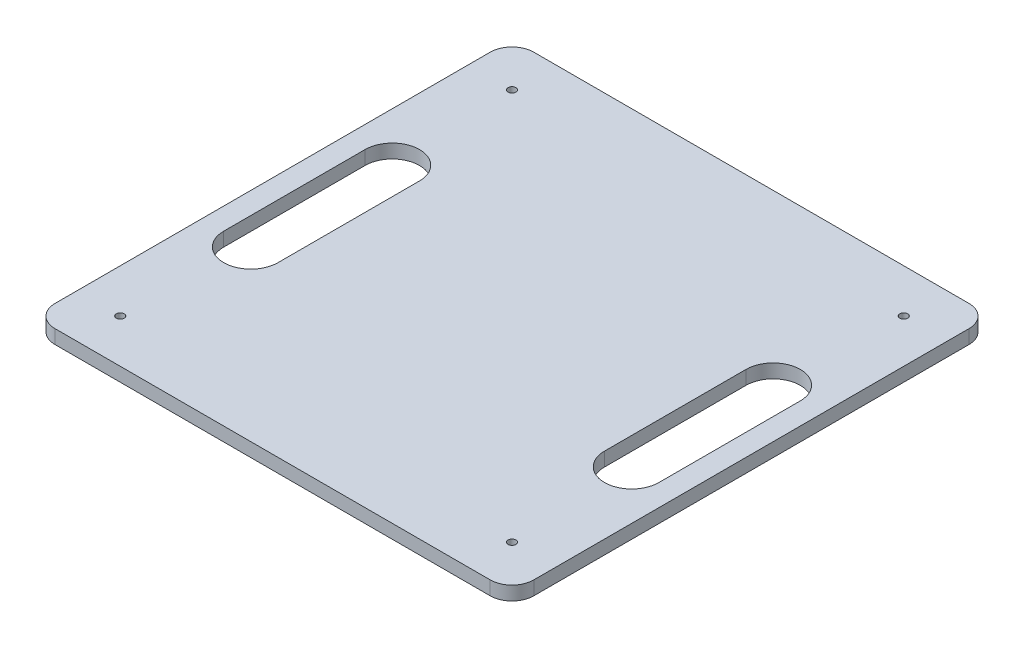
ISO-10303-21;
HEADER;
FILE_DESCRIPTION(('STEP AP214'),'2;1');
FILE_NAME('part.step','',(''),(''),'','','');
FILE_SCHEMA(('AUTOMOTIVE_DESIGN { 1 0 10303 214 1 1 1 1 }'));
ENDSEC;
DATA;
#1=APPLICATION_CONTEXT('core data for automotive mechanical design processes');
#2=APPLICATION_PROTOCOL_DEFINITION('international standard','automotive_design',2000,#1);
#3=PRODUCT_CONTEXT('',#1,'mechanical');
#4=PRODUCT('Part','Part','',(#3));
#5=PRODUCT_RELATED_PRODUCT_CATEGORY('part','',(#4));
#6=PRODUCT_DEFINITION_FORMATION('','',#4);
#7=PRODUCT_DEFINITION_CONTEXT('part definition',#1,'design');
#8=PRODUCT_DEFINITION('design','',#6,#7);
#9=PRODUCT_DEFINITION_SHAPE('','',#8);
#10=(LENGTH_UNIT() NAMED_UNIT(*) SI_UNIT(.MILLI.,.METRE.));
#11=(NAMED_UNIT(*) PLANE_ANGLE_UNIT() SI_UNIT($,.RADIAN.));
#12=(NAMED_UNIT(*) SI_UNIT($,.STERADIAN.) SOLID_ANGLE_UNIT());
#13=UNCERTAINTY_MEASURE_WITH_UNIT(LENGTH_MEASURE(1.E-05),#10,'distance_accuracy_value','');
#14=(GEOMETRIC_REPRESENTATION_CONTEXT(3) GLOBAL_UNCERTAINTY_ASSIGNED_CONTEXT((#13)) GLOBAL_UNIT_ASSIGNED_CONTEXT((#10,
#11,#12)) REPRESENTATION_CONTEXT('',''));
#15=CARTESIAN_POINT('',(0.,0.,0.));
#16=DIRECTION('',(0.,0.,1.));
#17=DIRECTION('',(1.,0.,0.));
#18=AXIS2_PLACEMENT_3D('',#15,#16,#17);
#19=CARTESIAN_POINT('',(110.,6.35,-110.));
#20=DIRECTION('',(-1.,0.,0.));
#21=DIRECTION('',(0.,0.,1.));
#22=AXIS2_PLACEMENT_3D('',#19,#20,#21);
#23=PLANE('',#22);
#24=DIRECTION('',(0.,0.,-1.));
#25=VECTOR('',#24,1.);
#26=CARTESIAN_POINT('',(110.,0.,-110.));
#27=LINE('',#26,#25);
#28=CARTESIAN_POINT('',(110.,0.,100.));
#29=VERTEX_POINT('',#28);
#30=CARTESIAN_POINT('',(110.,0.,-100.));
#31=VERTEX_POINT('',#30);
#32=EDGE_CURVE('E229',#29,#31,#27,.T.);
#33=ORIENTED_EDGE('',*,*,#32,.T.);
#34=DIRECTION('',(0.,-1.,0.));
#35=VECTOR('',#34,1.);
#36=CARTESIAN_POINT('',(110.,6.35,-100.));
#37=LINE('',#36,#35);
#38=CARTESIAN_POINT('',(110.,6.35,-100.));
#39=VERTEX_POINT('',#38);
#40=EDGE_CURVE('E271',#31,#39,#37,.F.);
#41=ORIENTED_EDGE('',*,*,#40,.T.);
#42=DIRECTION('',(0.,0.,-1.));
#43=VECTOR('',#42,1.);
#44=CARTESIAN_POINT('',(110.,6.35,-110.));
#45=LINE('',#44,#43);
#46=CARTESIAN_POINT('',(110.,6.35,100.));
#47=VERTEX_POINT('',#46);
#48=EDGE_CURVE('E232',#47,#39,#45,.T.);
#49=ORIENTED_EDGE('',*,*,#48,.F.);
#50=DIRECTION('',(0.,-1.,0.));
#51=VECTOR('',#50,1.);
#52=CARTESIAN_POINT('',(110.,6.35,100.));
#53=LINE('',#52,#51);
#54=EDGE_CURVE('E268',#47,#29,#53,.T.);
#55=ORIENTED_EDGE('',*,*,#54,.T.);
#56=EDGE_LOOP('',(#33,#41,#49,#55));
#57=FACE_BOUND('',#56,.T.);
#58=ADVANCED_FACE('F43',(#57),#23,.F.);
#59=CARTESIAN_POINT('',(-110.,6.35,-110.));
#60=DIRECTION('',(0.,0.,1.));
#61=DIRECTION('',(1.,0.,0.));
#62=AXIS2_PLACEMENT_3D('',#59,#60,#61);
#63=PLANE('',#62);
#64=DIRECTION('',(-1.,0.,0.));
#65=VECTOR('',#64,1.);
#66=CARTESIAN_POINT('',(-110.,6.35,-110.));
#67=LINE('',#66,#65);
#68=CARTESIAN_POINT('',(100.,6.35,-110.));
#69=VERTEX_POINT('',#68);
#70=CARTESIAN_POINT('',(-100.,6.35,-110.));
#71=VERTEX_POINT('',#70);
#72=EDGE_CURVE('E235',#69,#71,#67,.T.);
#73=ORIENTED_EDGE('',*,*,#72,.F.);
#74=DIRECTION('',(0.,-1.,0.));
#75=VECTOR('',#74,1.);
#76=CARTESIAN_POINT('',(100.,6.35,-110.));
#77=LINE('',#76,#75);
#78=CARTESIAN_POINT('',(100.,0.,-110.));
#79=VERTEX_POINT('',#78);
#80=EDGE_CURVE('E257',#69,#79,#77,.T.);
#81=ORIENTED_EDGE('',*,*,#80,.T.);
#82=DIRECTION('',(-1.,0.,0.));
#83=VECTOR('',#82,1.);
#84=CARTESIAN_POINT('',(-110.,0.,-110.));
#85=LINE('',#84,#83);
#86=CARTESIAN_POINT('',(-100.,0.,-110.));
#87=VERTEX_POINT('',#86);
#88=EDGE_CURVE('E248',#79,#87,#85,.T.);
#89=ORIENTED_EDGE('',*,*,#88,.T.);
#90=DIRECTION('',(0.,-1.,0.));
#91=VECTOR('',#90,1.);
#92=CARTESIAN_POINT('',(-100.,6.35,-110.));
#93=LINE('',#92,#91);
#94=EDGE_CURVE('E245',#87,#71,#93,.F.);
#95=ORIENTED_EDGE('',*,*,#94,.T.);
#96=EDGE_LOOP('',(#73,#81,#89,#95));
#97=FACE_BOUND('',#96,.T.);
#98=ADVANCED_FACE('F327',(#97),#63,.F.);
#99=CARTESIAN_POINT('',(-110.,6.35,-110.));
#100=DIRECTION('',(1.,0.,0.));
#101=DIRECTION('',(0.,0.,-1.));
#102=AXIS2_PLACEMENT_3D('',#99,#100,#101);
#103=PLANE('',#102);
#104=DIRECTION('',(0.,0.,1.));
#105=VECTOR('',#104,1.);
#106=CARTESIAN_POINT('',(-110.,6.35,-110.));
#107=LINE('',#106,#105);
#108=CARTESIAN_POINT('',(-110.,6.35,-100.));
#109=VERTEX_POINT('',#108);
#110=CARTESIAN_POINT('',(-110.,6.35,100.));
#111=VERTEX_POINT('',#110);
#112=EDGE_CURVE('E239',#109,#111,#107,.T.);
#113=ORIENTED_EDGE('',*,*,#112,.F.);
#114=DIRECTION('',(0.,-1.,0.));
#115=VECTOR('',#114,1.);
#116=CARTESIAN_POINT('',(-110.,6.35,-100.));
#117=LINE('',#116,#115);
#118=CARTESIAN_POINT('',(-110.,0.,-100.));
#119=VERTEX_POINT('',#118);
#120=EDGE_CURVE('E283',#109,#119,#117,.T.);
#121=ORIENTED_EDGE('',*,*,#120,.T.);
#122=DIRECTION('',(0.,0.,1.));
#123=VECTOR('',#122,1.);
#124=CARTESIAN_POINT('',(-110.,0.,-110.));
#125=LINE('',#124,#123);
#126=CARTESIAN_POINT('',(-110.,0.,100.));
#127=VERTEX_POINT('',#126);
#128=EDGE_CURVE('E251',#119,#127,#125,.T.);
#129=ORIENTED_EDGE('',*,*,#128,.T.);
#130=DIRECTION('',(0.,-1.,0.));
#131=VECTOR('',#130,1.);
#132=CARTESIAN_POINT('',(-110.,6.35,100.));
#133=LINE('',#132,#131);
#134=EDGE_CURVE('E281',#127,#111,#133,.F.);
#135=ORIENTED_EDGE('',*,*,#134,.T.);
#136=EDGE_LOOP('',(#113,#121,#129,#135));
#137=FACE_BOUND('',#136,.T.);
#138=ADVANCED_FACE('F334',(#137),#103,.F.);
#139=CARTESIAN_POINT('',(-110.,6.35,110.));
#140=DIRECTION('',(0.,0.,-1.));
#141=DIRECTION('',(-1.,0.,0.));
#142=AXIS2_PLACEMENT_3D('',#139,#140,#141);
#143=PLANE('',#142);
#144=DIRECTION('',(1.,0.,0.));
#145=VECTOR('',#144,1.);
#146=CARTESIAN_POINT('',(-110.,6.35,110.));
#147=LINE('',#146,#145);
#148=CARTESIAN_POINT('',(-100.,6.35,110.));
#149=VERTEX_POINT('',#148);
#150=CARTESIAN_POINT('',(100.,6.35,110.));
#151=VERTEX_POINT('',#150);
#152=EDGE_CURVE('E242',#149,#151,#147,.T.);
#153=ORIENTED_EDGE('',*,*,#152,.F.);
#154=DIRECTION('',(0.,-1.,0.));
#155=VECTOR('',#154,1.);
#156=CARTESIAN_POINT('',(-100.,6.35,110.));
#157=LINE('',#156,#155);
#158=CARTESIAN_POINT('',(-100.,0.,110.));
#159=VERTEX_POINT('',#158);
#160=EDGE_CURVE('E288',#149,#159,#157,.T.);
#161=ORIENTED_EDGE('',*,*,#160,.T.);
#162=DIRECTION('',(1.,0.,0.));
#163=VECTOR('',#162,1.);
#164=CARTESIAN_POINT('',(-110.,0.,110.));
#165=LINE('',#164,#163);
#166=CARTESIAN_POINT('',(100.,0.,110.));
#167=VERTEX_POINT('',#166);
#168=EDGE_CURVE('E236',#159,#167,#165,.T.);
#169=ORIENTED_EDGE('',*,*,#168,.T.);
#170=DIRECTION('',(0.,-1.,0.));
#171=VECTOR('',#170,1.);
#172=CARTESIAN_POINT('',(100.,6.35,110.));
#173=LINE('',#172,#171);
#174=EDGE_CURVE('E286',#167,#151,#173,.F.);
#175=ORIENTED_EDGE('',*,*,#174,.T.);
#176=EDGE_LOOP('',(#153,#161,#169,#175));
#177=FACE_BOUND('',#176,.T.);
#178=ADVANCED_FACE('F363',(#177),#143,.F.);
#179=CARTESIAN_POINT('',(0.,6.35,0.));
#180=DIRECTION('',(0.,1.,0.));
#181=DIRECTION('',(0.,0.,1.));
#182=AXIS2_PLACEMENT_3D('',#179,#180,#181);
#183=PLANE('',#182);
#184=CARTESIAN_POINT('',(-87.5,6.35,-32.5));
#185=DIRECTION('',(0.,1.,0.));
#186=DIRECTION('',(0.,0.,1.));
#187=AXIS2_PLACEMENT_3D('',#184,#185,#186);
#188=CIRCLE('',#187,12.4999999999999);
#189=CARTESIAN_POINT('',(-75.0000000000001,6.35,-32.5));
#190=VERTEX_POINT('',#189);
#191=CARTESIAN_POINT('',(-100.,6.35,-32.5));
#192=VERTEX_POINT('',#191);
#193=EDGE_CURVE('E58',#190,#192,#188,.T.);
#194=ORIENTED_EDGE('',*,*,#193,.F.);
#195=DIRECTION('',(0.,0.,-1.));
#196=VECTOR('',#195,1.);
#197=CARTESIAN_POINT('',(-75.0000000000001,6.35,-32.5));
#198=LINE('',#197,#196);
#199=CARTESIAN_POINT('',(-75.0000000000001,6.35,32.4999999999998));
#200=VERTEX_POINT('',#199);
#201=EDGE_CURVE('E180',#200,#190,#198,.T.);
#202=ORIENTED_EDGE('',*,*,#201,.F.);
#203=CARTESIAN_POINT('',(-87.5000000000001,6.35,32.5));
#204=DIRECTION('',(0.,1.,0.));
#205=DIRECTION('',(0.,0.,1.));
#206=AXIS2_PLACEMENT_3D('',#203,#204,#205);
#207=CIRCLE('',#206,12.4999999999999);
#208=CARTESIAN_POINT('',(-100.,6.35,32.5));
#209=VERTEX_POINT('',#208);
#210=EDGE_CURVE('E163',#209,#200,#207,.T.);
#211=ORIENTED_EDGE('',*,*,#210,.F.);
#212=DIRECTION('',(0.,0.,1.));
#213=VECTOR('',#212,1.);
#214=CARTESIAN_POINT('',(-100.,6.35,-32.5));
#215=LINE('',#214,#213);
#216=EDGE_CURVE('E173',#192,#209,#215,.T.);
#217=ORIENTED_EDGE('',*,*,#216,.F.);
#218=EDGE_LOOP('',(#194,#202,#211,#217));
#219=FACE_BOUND('',#218,.T.);
#220=CARTESIAN_POINT('',(87.5000000000001,6.35,32.5));
#221=DIRECTION('',(0.,1.,0.));
#222=DIRECTION('',(0.,0.,-1.));
#223=AXIS2_PLACEMENT_3D('',#220,#221,#222);
#224=CIRCLE('',#223,12.4999999999999);
#225=CARTESIAN_POINT('',(75.0000000000001,6.35,32.4999999999998));
#226=VERTEX_POINT('',#225);
#227=CARTESIAN_POINT('',(100.,6.35,32.5));
#228=VERTEX_POINT('',#227);
#229=EDGE_CURVE('E66',#226,#228,#224,.T.);
#230=ORIENTED_EDGE('',*,*,#229,.F.);
#231=DIRECTION('',(0.,0.,1.));
#232=VECTOR('',#231,1.);
#233=CARTESIAN_POINT('',(75.0000000000002,6.35,-32.5));
#234=LINE('',#233,#232);
#235=CARTESIAN_POINT('',(75.0000000000001,6.35,-32.5));
#236=VERTEX_POINT('',#235);
#237=EDGE_CURVE('E197',#236,#226,#234,.T.);
#238=ORIENTED_EDGE('',*,*,#237,.F.);
#239=CARTESIAN_POINT('',(87.5,6.35,-32.5));
#240=DIRECTION('',(0.,1.,0.));
#241=DIRECTION('',(0.,0.,-1.));
#242=AXIS2_PLACEMENT_3D('',#239,#240,#241);
#243=CIRCLE('',#242,12.4999999999999);
#244=CARTESIAN_POINT('',(100.,6.35,-32.5));
#245=VERTEX_POINT('',#244);
#246=EDGE_CURVE('E194',#245,#236,#243,.T.);
#247=ORIENTED_EDGE('',*,*,#246,.F.);
#248=DIRECTION('',(0.,0.,-1.));
#249=VECTOR('',#248,1.);
#250=CARTESIAN_POINT('',(100.,6.35,-32.5));
#251=LINE('',#250,#249);
#252=EDGE_CURVE('E191',#228,#245,#251,.T.);
#253=ORIENTED_EDGE('',*,*,#252,.F.);
#254=EDGE_LOOP('',(#230,#238,#247,#253));
#255=FACE_BOUND('',#254,.T.);
#256=CARTESIAN_POINT('',(90.0000000000001,6.35,90.0000000000001));
#257=DIRECTION('',(0.,-1.,0.));
#258=DIRECTION('',(0.,0.,-1.));
#259=AXIS2_PLACEMENT_3D('',#256,#257,#258);
#260=CIRCLE('',#259,1.80000000000021);
#261=CARTESIAN_POINT('',(90.0000000000001,6.35,88.1999999999999));
#262=VERTEX_POINT('',#261);
#263=EDGE_CURVE('E221',#262,#262,#260,.T.);
#264=ORIENTED_EDGE('',*,*,#263,.T.);
#265=EDGE_LOOP('',(#264));
#266=FACE_BOUND('',#265,.T.);
#267=CARTESIAN_POINT('',(90.0000000000001,6.35,-89.9999999999999));
#268=DIRECTION('',(0.,-1.,0.));
#269=DIRECTION('',(0.,0.,-1.));
#270=AXIS2_PLACEMENT_3D('',#267,#268,#269);
#271=CIRCLE('',#270,1.79999999999989);
#272=CARTESIAN_POINT('',(90.0000000000001,6.35,-91.7999999999998));
#273=VERTEX_POINT('',#272);
#274=EDGE_CURVE('E215',#273,#273,#271,.T.);
#275=ORIENTED_EDGE('',*,*,#274,.T.);
#276=EDGE_LOOP('',(#275));
#277=FACE_BOUND('',#276,.T.);
#278=CARTESIAN_POINT('',(-90.,6.35,-89.9999999999999));
#279=DIRECTION('',(0.,-1.,0.));
#280=DIRECTION('',(0.,0.,-1.));
#281=AXIS2_PLACEMENT_3D('',#278,#279,#280);
#282=CIRCLE('',#281,1.79999999999969);
#283=CARTESIAN_POINT('',(-90.,6.35,-91.7999999999996));
#284=VERTEX_POINT('',#283);
#285=EDGE_CURVE('E208',#284,#284,#282,.T.);
#286=ORIENTED_EDGE('',*,*,#285,.T.);
#287=EDGE_LOOP('',(#286));
#288=FACE_BOUND('',#287,.T.);
#289=CARTESIAN_POINT('',(-90.,6.35,90.0000000000001));
#290=DIRECTION('',(0.,-1.,0.));
#291=DIRECTION('',(0.,0.,-1.));
#292=AXIS2_PLACEMENT_3D('',#289,#290,#291);
#293=CIRCLE('',#292,1.79999999999999);
#294=CARTESIAN_POINT('',(-90.,6.35,88.2000000000001));
#295=VERTEX_POINT('',#294);
#296=EDGE_CURVE('E226',#295,#295,#293,.T.);
#297=ORIENTED_EDGE('',*,*,#296,.T.);
#298=EDGE_LOOP('',(#297));
#299=FACE_BOUND('',#298,.T.);
#300=ORIENTED_EDGE('',*,*,#48,.T.);
#301=CARTESIAN_POINT('',(100.,6.35,-100.));
#302=DIRECTION('',(0.,1.,0.));
#303=DIRECTION('',(0.,0.,1.));
#304=AXIS2_PLACEMENT_3D('',#301,#302,#303);
#305=CIRCLE('',#304,10.);
#306=EDGE_CURVE('E279',#39,#69,#305,.T.);
#307=ORIENTED_EDGE('',*,*,#306,.T.);
#308=ORIENTED_EDGE('',*,*,#72,.T.);
#309=CARTESIAN_POINT('',(-100.,6.35,-100.));
#310=DIRECTION('',(0.,1.,0.));
#311=DIRECTION('',(0.,0.,1.));
#312=AXIS2_PLACEMENT_3D('',#309,#310,#311);
#313=CIRCLE('',#312,10.);
#314=EDGE_CURVE('E277',#71,#109,#313,.T.);
#315=ORIENTED_EDGE('',*,*,#314,.T.);
#316=ORIENTED_EDGE('',*,*,#112,.T.);
#317=CARTESIAN_POINT('',(-100.,6.35,100.));
#318=DIRECTION('',(0.,1.,0.));
#319=DIRECTION('',(0.,0.,1.));
#320=AXIS2_PLACEMENT_3D('',#317,#318,#319);
#321=CIRCLE('',#320,10.);
#322=EDGE_CURVE('E275',#111,#149,#321,.T.);
#323=ORIENTED_EDGE('',*,*,#322,.T.);
#324=ORIENTED_EDGE('',*,*,#152,.T.);
#325=CARTESIAN_POINT('',(100.,6.35,100.));
#326=DIRECTION('',(0.,1.,0.));
#327=DIRECTION('',(0.,0.,1.));
#328=AXIS2_PLACEMENT_3D('',#325,#326,#327);
#329=CIRCLE('',#328,10.);
#330=EDGE_CURVE('E273',#151,#47,#329,.T.);
#331=ORIENTED_EDGE('',*,*,#330,.T.);
#332=EDGE_LOOP('',(#300,#307,#308,#315,#316,#323,#324,#331));
#333=FACE_BOUND('',#332,.T.);
#334=ADVANCED_FACE('F177',(#219,#255,#266,#277,#288,#299,#333),#183,.T.);
#335=CARTESIAN_POINT('',(0.,0.,0.));
#336=DIRECTION('',(0.,1.,0.));
#337=DIRECTION('',(0.,0.,1.));
#338=AXIS2_PLACEMENT_3D('',#335,#336,#337);
#339=PLANE('',#338);
#340=DIRECTION('',(0.,0.,-1.));
#341=VECTOR('',#340,1.);
#342=CARTESIAN_POINT('',(-75.0000000000001,0.,0.));
#343=LINE('',#342,#341);
#344=CARTESIAN_POINT('',(-75.0000000000001,0.,32.4999999999998));
#345=VERTEX_POINT('',#344);
#346=CARTESIAN_POINT('',(-75.0000000000001,0.,-32.5));
#347=VERTEX_POINT('',#346);
#348=EDGE_CURVE('E51',#345,#347,#343,.T.);
#349=ORIENTED_EDGE('',*,*,#348,.T.);
#350=CARTESIAN_POINT('',(-87.5,0.,-32.5));
#351=DIRECTION('',(0.,1.,0.));
#352=DIRECTION('',(0.,0.,1.));
#353=AXIS2_PLACEMENT_3D('',#350,#351,#352);
#354=CIRCLE('',#353,12.4999999999999);
#355=CARTESIAN_POINT('',(-100.,0.,-32.5));
#356=VERTEX_POINT('',#355);
#357=EDGE_CURVE('E11',#347,#356,#354,.T.);
#358=ORIENTED_EDGE('',*,*,#357,.T.);
#359=DIRECTION('',(0.,0.,1.));
#360=VECTOR('',#359,1.);
#361=CARTESIAN_POINT('',(-100.,0.,0.));
#362=LINE('',#361,#360);
#363=CARTESIAN_POINT('',(-100.,0.,32.5));
#364=VERTEX_POINT('',#363);
#365=EDGE_CURVE('E303',#356,#364,#362,.T.);
#366=ORIENTED_EDGE('',*,*,#365,.T.);
#367=CARTESIAN_POINT('',(-87.5000000000001,0.,32.5));
#368=DIRECTION('',(0.,1.,0.));
#369=DIRECTION('',(0.,0.,1.));
#370=AXIS2_PLACEMENT_3D('',#367,#368,#369);
#371=CIRCLE('',#370,12.4999999999999);
#372=EDGE_CURVE('E166',#364,#345,#371,.T.);
#373=ORIENTED_EDGE('',*,*,#372,.T.);
#374=EDGE_LOOP('',(#349,#358,#366,#373));
#375=FACE_BOUND('',#374,.T.);
#376=DIRECTION('',(0.,0.,1.));
#377=VECTOR('',#376,1.);
#378=CARTESIAN_POINT('',(75.0000000000001,0.,0.));
#379=LINE('',#378,#377);
#380=CARTESIAN_POINT('',(75.0000000000001,0.,-32.5));
#381=VERTEX_POINT('',#380);
#382=CARTESIAN_POINT('',(75.0000000000001,0.,32.4999999999998));
#383=VERTEX_POINT('',#382);
#384=EDGE_CURVE('E297',#381,#383,#379,.T.);
#385=ORIENTED_EDGE('',*,*,#384,.T.);
#386=CARTESIAN_POINT('',(87.5000000000001,0.,32.5));
#387=DIRECTION('',(0.,1.,0.));
#388=DIRECTION('',(0.,0.,1.));
#389=AXIS2_PLACEMENT_3D('',#386,#387,#388);
#390=CIRCLE('',#389,12.4999999999999);
#391=CARTESIAN_POINT('',(100.,0.,32.5));
#392=VERTEX_POINT('',#391);
#393=EDGE_CURVE('E300',#383,#392,#390,.T.);
#394=ORIENTED_EDGE('',*,*,#393,.T.);
#395=DIRECTION('',(0.,0.,-1.));
#396=VECTOR('',#395,1.);
#397=CARTESIAN_POINT('',(100.,0.,0.));
#398=LINE('',#397,#396);
#399=CARTESIAN_POINT('',(100.,0.,-32.5));
#400=VERTEX_POINT('',#399);
#401=EDGE_CURVE('E291',#392,#400,#398,.T.);
#402=ORIENTED_EDGE('',*,*,#401,.T.);
#403=CARTESIAN_POINT('',(87.5,0.,-32.5));
#404=DIRECTION('',(0.,1.,0.));
#405=DIRECTION('',(0.,0.,1.));
#406=AXIS2_PLACEMENT_3D('',#403,#404,#405);
#407=CIRCLE('',#406,12.4999999999999);
#408=EDGE_CURVE('E294',#400,#381,#407,.T.);
#409=ORIENTED_EDGE('',*,*,#408,.T.);
#410=EDGE_LOOP('',(#385,#394,#402,#409));
#411=FACE_BOUND('',#410,.T.);
#412=CARTESIAN_POINT('',(90.0000000000001,0.,90.0000000000001));
#413=DIRECTION('',(0.,-1.,0.));
#414=DIRECTION('',(0.,0.,-1.));
#415=AXIS2_PLACEMENT_3D('',#412,#413,#414);
#416=CIRCLE('',#415,1.80000000000021);
#417=CARTESIAN_POINT('',(90.0000000000001,0.,88.1999999999999));
#418=VERTEX_POINT('',#417);
#419=EDGE_CURVE('E187',#418,#418,#416,.T.);
#420=ORIENTED_EDGE('',*,*,#419,.F.);
#421=EDGE_LOOP('',(#420));
#422=FACE_BOUND('',#421,.T.);
#423=CARTESIAN_POINT('',(90.0000000000001,0.,-89.9999999999999));
#424=DIRECTION('',(0.,-1.,0.));
#425=DIRECTION('',(0.,0.,-1.));
#426=AXIS2_PLACEMENT_3D('',#423,#424,#425);
#427=CIRCLE('',#426,1.79999999999989);
#428=CARTESIAN_POINT('',(90.0000000000001,0.,-91.7999999999998));
#429=VERTEX_POINT('',#428);
#430=EDGE_CURVE('E218',#429,#429,#427,.T.);
#431=ORIENTED_EDGE('',*,*,#430,.F.);
#432=EDGE_LOOP('',(#431));
#433=FACE_BOUND('',#432,.T.);
#434=CARTESIAN_POINT('',(-90.,0.,-89.9999999999999));
#435=DIRECTION('',(0.,-1.,0.));
#436=DIRECTION('',(0.,0.,-1.));
#437=AXIS2_PLACEMENT_3D('',#434,#435,#436);
#438=CIRCLE('',#437,1.79999999999969);
#439=CARTESIAN_POINT('',(-90.,0.,-91.7999999999996));
#440=VERTEX_POINT('',#439);
#441=EDGE_CURVE('E212',#440,#440,#438,.T.);
#442=ORIENTED_EDGE('',*,*,#441,.F.);
#443=EDGE_LOOP('',(#442));
#444=FACE_BOUND('',#443,.T.);
#445=CARTESIAN_POINT('',(-90.,0.,90.0000000000001));
#446=DIRECTION('',(0.,-1.,0.));
#447=DIRECTION('',(0.,0.,-1.));
#448=AXIS2_PLACEMENT_3D('',#445,#446,#447);
#449=CIRCLE('',#448,1.79999999999999);
#450=CARTESIAN_POINT('',(-90.,0.,88.2000000000001));
#451=VERTEX_POINT('',#450);
#452=EDGE_CURVE('E211',#451,#451,#449,.T.);
#453=ORIENTED_EDGE('',*,*,#452,.F.);
#454=EDGE_LOOP('',(#453));
#455=FACE_BOUND('',#454,.T.);
#456=ORIENTED_EDGE('',*,*,#88,.F.);
#457=CARTESIAN_POINT('',(100.,0.,-100.));
#458=DIRECTION('',(0.,1.,0.));
#459=DIRECTION('',(0.,0.,1.));
#460=AXIS2_PLACEMENT_3D('',#457,#458,#459);
#461=CIRCLE('',#460,10.);
#462=EDGE_CURVE('E266',#79,#31,#461,.F.);
#463=ORIENTED_EDGE('',*,*,#462,.T.);
#464=ORIENTED_EDGE('',*,*,#32,.F.);
#465=CARTESIAN_POINT('',(100.,0.,100.));
#466=DIRECTION('',(0.,1.,0.));
#467=DIRECTION('',(0.,0.,1.));
#468=AXIS2_PLACEMENT_3D('',#465,#466,#467);
#469=CIRCLE('',#468,10.);
#470=EDGE_CURVE('E260',#29,#167,#469,.F.);
#471=ORIENTED_EDGE('',*,*,#470,.T.);
#472=ORIENTED_EDGE('',*,*,#168,.F.);
#473=CARTESIAN_POINT('',(-100.,0.,100.));
#474=DIRECTION('',(0.,1.,0.));
#475=DIRECTION('',(0.,0.,1.));
#476=AXIS2_PLACEMENT_3D('',#473,#474,#475);
#477=CIRCLE('',#476,10.);
#478=EDGE_CURVE('E262',#159,#127,#477,.F.);
#479=ORIENTED_EDGE('',*,*,#478,.T.);
#480=ORIENTED_EDGE('',*,*,#128,.F.);
#481=CARTESIAN_POINT('',(-100.,0.,-100.));
#482=DIRECTION('',(0.,1.,0.));
#483=DIRECTION('',(0.,0.,1.));
#484=AXIS2_PLACEMENT_3D('',#481,#482,#483);
#485=CIRCLE('',#484,10.);
#486=EDGE_CURVE('E264',#119,#87,#485,.F.);
#487=ORIENTED_EDGE('',*,*,#486,.T.);
#488=EDGE_LOOP('',(#456,#463,#464,#471,#472,#479,#480,#487));
#489=FACE_BOUND('',#488,.T.);
#490=ADVANCED_FACE('F307',(#375,#411,#422,#433,#444,#455,#489),#339,.F.);
#491=CARTESIAN_POINT('',(-90.,6.35,90.0000000000001));
#492=DIRECTION('',(0.,-1.,0.));
#493=DIRECTION('',(0.,0.,-1.));
#494=AXIS2_PLACEMENT_3D('',#491,#492,#493);
#495=CYLINDRICAL_SURFACE('',#494,1.79999999999999);
#496=ORIENTED_EDGE('',*,*,#296,.F.);
#497=EDGE_LOOP('',(#496));
#498=FACE_BOUND('',#497,.T.);
#499=ORIENTED_EDGE('',*,*,#452,.T.);
#500=EDGE_LOOP('',(#499));
#501=FACE_BOUND('',#500,.T.);
#502=ADVANCED_FACE('F381',(#498,#501),#495,.F.);
#503=CARTESIAN_POINT('',(-90.,6.35,-89.9999999999999));
#504=DIRECTION('',(0.,-1.,0.));
#505=DIRECTION('',(0.,0.,-1.));
#506=AXIS2_PLACEMENT_3D('',#503,#504,#505);
#507=CYLINDRICAL_SURFACE('',#506,1.79999999999969);
#508=ORIENTED_EDGE('',*,*,#285,.F.);
#509=EDGE_LOOP('',(#508));
#510=FACE_BOUND('',#509,.T.);
#511=ORIENTED_EDGE('',*,*,#441,.T.);
#512=EDGE_LOOP('',(#511));
#513=FACE_BOUND('',#512,.T.);
#514=ADVANCED_FACE('F388',(#510,#513),#507,.F.);
#515=CARTESIAN_POINT('',(90.0000000000001,6.35,-89.9999999999999));
#516=DIRECTION('',(0.,-1.,0.));
#517=DIRECTION('',(0.,0.,-1.));
#518=AXIS2_PLACEMENT_3D('',#515,#516,#517);
#519=CYLINDRICAL_SURFACE('',#518,1.79999999999989);
#520=ORIENTED_EDGE('',*,*,#274,.F.);
#521=EDGE_LOOP('',(#520));
#522=FACE_BOUND('',#521,.T.);
#523=ORIENTED_EDGE('',*,*,#430,.T.);
#524=EDGE_LOOP('',(#523));
#525=FACE_BOUND('',#524,.T.);
#526=ADVANCED_FACE('F449',(#522,#525),#519,.F.);
#527=CARTESIAN_POINT('',(90.0000000000001,6.35,90.0000000000001));
#528=DIRECTION('',(0.,-1.,0.));
#529=DIRECTION('',(0.,0.,-1.));
#530=AXIS2_PLACEMENT_3D('',#527,#528,#529);
#531=CYLINDRICAL_SURFACE('',#530,1.80000000000021);
#532=ORIENTED_EDGE('',*,*,#263,.F.);
#533=EDGE_LOOP('',(#532));
#534=FACE_BOUND('',#533,.T.);
#535=ORIENTED_EDGE('',*,*,#419,.T.);
#536=EDGE_LOOP('',(#535));
#537=FACE_BOUND('',#536,.T.);
#538=ADVANCED_FACE('F343',(#534,#537),#531,.F.);
#539=CARTESIAN_POINT('',(100.,6.35,-100.));
#540=DIRECTION('',(0.,-1.,0.));
#541=DIRECTION('',(0.,0.,-1.));
#542=AXIS2_PLACEMENT_3D('',#539,#540,#541);
#543=CYLINDRICAL_SURFACE('',#542,10.);
#544=ORIENTED_EDGE('',*,*,#306,.F.);
#545=ORIENTED_EDGE('',*,*,#40,.F.);
#546=ORIENTED_EDGE('',*,*,#462,.F.);
#547=ORIENTED_EDGE('',*,*,#80,.F.);
#548=EDGE_LOOP('',(#544,#545,#546,#547));
#549=FACE_BOUND('',#548,.T.);
#550=ADVANCED_FACE('F339',(#549),#543,.T.);
#551=CARTESIAN_POINT('',(-100.,6.35,-100.));
#552=DIRECTION('',(0.,-1.,0.));
#553=DIRECTION('',(0.,0.,-1.));
#554=AXIS2_PLACEMENT_3D('',#551,#552,#553);
#555=CYLINDRICAL_SURFACE('',#554,10.);
#556=ORIENTED_EDGE('',*,*,#314,.F.);
#557=ORIENTED_EDGE('',*,*,#94,.F.);
#558=ORIENTED_EDGE('',*,*,#486,.F.);
#559=ORIENTED_EDGE('',*,*,#120,.F.);
#560=EDGE_LOOP('',(#556,#557,#558,#559));
#561=FACE_BOUND('',#560,.T.);
#562=ADVANCED_FACE('F342',(#561),#555,.T.);
#563=CARTESIAN_POINT('',(-100.,6.35,100.));
#564=DIRECTION('',(0.,-1.,0.));
#565=DIRECTION('',(0.,0.,-1.));
#566=AXIS2_PLACEMENT_3D('',#563,#564,#565);
#567=CYLINDRICAL_SURFACE('',#566,10.);
#568=ORIENTED_EDGE('',*,*,#322,.F.);
#569=ORIENTED_EDGE('',*,*,#134,.F.);
#570=ORIENTED_EDGE('',*,*,#478,.F.);
#571=ORIENTED_EDGE('',*,*,#160,.F.);
#572=EDGE_LOOP('',(#568,#569,#570,#571));
#573=FACE_BOUND('',#572,.T.);
#574=ADVANCED_FACE('F346',(#573),#567,.T.);
#575=CARTESIAN_POINT('',(100.,6.35,100.));
#576=DIRECTION('',(0.,-1.,0.));
#577=DIRECTION('',(0.,0.,-1.));
#578=AXIS2_PLACEMENT_3D('',#575,#576,#577);
#579=CYLINDRICAL_SURFACE('',#578,10.);
#580=ORIENTED_EDGE('',*,*,#330,.F.);
#581=ORIENTED_EDGE('',*,*,#174,.F.);
#582=ORIENTED_EDGE('',*,*,#470,.F.);
#583=ORIENTED_EDGE('',*,*,#54,.F.);
#584=EDGE_LOOP('',(#580,#581,#582,#583));
#585=FACE_BOUND('',#584,.T.);
#586=ADVANCED_FACE('F45',(#585),#579,.T.);
#587=CARTESIAN_POINT('',(87.5000000000001,-3.65,32.5));
#588=DIRECTION('',(0.,1.,0.));
#589=DIRECTION('',(0.,0.,1.));
#590=AXIS2_PLACEMENT_3D('',#587,#588,#589);
#591=CYLINDRICAL_SURFACE('',#590,12.4999999999999);
#592=DIRECTION('',(0.,1.,0.));
#593=VECTOR('',#592,1.);
#594=CARTESIAN_POINT('',(75.0000000000001,-3.65,32.4999999999998));
#595=LINE('',#594,#593);
#596=EDGE_CURVE('E201',#383,#226,#595,.T.);
#597=ORIENTED_EDGE('',*,*,#596,.T.);
#598=ORIENTED_EDGE('',*,*,#229,.T.);
#599=DIRECTION('',(0.,1.,0.));
#600=VECTOR('',#599,1.);
#601=CARTESIAN_POINT('',(100.,-3.65,32.5));
#602=LINE('',#601,#600);
#603=EDGE_CURVE('E200',#392,#228,#602,.T.);
#604=ORIENTED_EDGE('',*,*,#603,.F.);
#605=ORIENTED_EDGE('',*,*,#393,.F.);
#606=EDGE_LOOP('',(#597,#598,#604,#605));
#607=FACE_BOUND('',#606,.T.);
#608=ADVANCED_FACE('F353',(#607),#591,.F.);
#609=CARTESIAN_POINT('',(75.0000000000002,-3.65,-32.5));
#610=DIRECTION('',(-1.,0.,0.));
#611=DIRECTION('',(0.,0.,1.));
#612=AXIS2_PLACEMENT_3D('',#609,#610,#611);
#613=PLANE('',#612);
#614=DIRECTION('',(0.,1.,0.));
#615=VECTOR('',#614,1.);
#616=CARTESIAN_POINT('',(75.0000000000001,-3.65,-32.5));
#617=LINE('',#616,#615);
#618=EDGE_CURVE('E203',#381,#236,#617,.T.);
#619=ORIENTED_EDGE('',*,*,#618,.T.);
#620=ORIENTED_EDGE('',*,*,#237,.T.);
#621=ORIENTED_EDGE('',*,*,#596,.F.);
#622=ORIENTED_EDGE('',*,*,#384,.F.);
#623=EDGE_LOOP('',(#619,#620,#621,#622));
#624=FACE_BOUND('',#623,.T.);
#625=ADVANCED_FACE('F475',(#624),#613,.F.);
#626=CARTESIAN_POINT('',(87.5,-3.65,-32.5));
#627=DIRECTION('',(0.,1.,0.));
#628=DIRECTION('',(0.,0.,1.));
#629=AXIS2_PLACEMENT_3D('',#626,#627,#628);
#630=CYLINDRICAL_SURFACE('',#629,12.4999999999999);
#631=DIRECTION('',(0.,1.,0.));
#632=VECTOR('',#631,1.);
#633=CARTESIAN_POINT('',(100.,-3.65,-32.5));
#634=LINE('',#633,#632);
#635=EDGE_CURVE('E205',#400,#245,#634,.T.);
#636=ORIENTED_EDGE('',*,*,#635,.T.);
#637=ORIENTED_EDGE('',*,*,#246,.T.);
#638=ORIENTED_EDGE('',*,*,#618,.F.);
#639=ORIENTED_EDGE('',*,*,#408,.F.);
#640=EDGE_LOOP('',(#636,#637,#638,#639));
#641=FACE_BOUND('',#640,.T.);
#642=ADVANCED_FACE('F321',(#641),#630,.F.);
#643=CARTESIAN_POINT('',(100.,-3.65,-32.5));
#644=DIRECTION('',(1.,0.,0.));
#645=DIRECTION('',(0.,0.,-1.));
#646=AXIS2_PLACEMENT_3D('',#643,#644,#645);
#647=PLANE('',#646);
#648=ORIENTED_EDGE('',*,*,#603,.T.);
#649=ORIENTED_EDGE('',*,*,#252,.T.);
#650=ORIENTED_EDGE('',*,*,#635,.F.);
#651=ORIENTED_EDGE('',*,*,#401,.F.);
#652=EDGE_LOOP('',(#648,#649,#650,#651));
#653=FACE_BOUND('',#652,.T.);
#654=ADVANCED_FACE('F314',(#653),#647,.F.);
#655=CARTESIAN_POINT('',(-87.5,-3.65,-32.5));
#656=DIRECTION('',(0.,1.,0.));
#657=DIRECTION('',(0.,0.,1.));
#658=AXIS2_PLACEMENT_3D('',#655,#656,#657);
#659=CYLINDRICAL_SURFACE('',#658,12.4999999999999);
#660=DIRECTION('',(0.,1.,0.));
#661=VECTOR('',#660,1.);
#662=CARTESIAN_POINT('',(-75.0000000000001,-3.65,-32.5));
#663=LINE('',#662,#661);
#664=EDGE_CURVE('E185',#347,#190,#663,.T.);
#665=ORIENTED_EDGE('',*,*,#664,.T.);
#666=ORIENTED_EDGE('',*,*,#193,.T.);
#667=DIRECTION('',(0.,1.,0.));
#668=VECTOR('',#667,1.);
#669=CARTESIAN_POINT('',(-100.,-3.65,-32.5));
#670=LINE('',#669,#668);
#671=EDGE_CURVE('E170',#356,#192,#670,.T.);
#672=ORIENTED_EDGE('',*,*,#671,.F.);
#673=ORIENTED_EDGE('',*,*,#357,.F.);
#674=EDGE_LOOP('',(#665,#666,#672,#673));
#675=FACE_BOUND('',#674,.T.);
#676=ADVANCED_FACE('F312',(#675),#659,.F.);
#677=CARTESIAN_POINT('',(-75.0000000000001,-3.65,-32.5));
#678=DIRECTION('',(1.,0.,0.));
#679=DIRECTION('',(0.,0.,-1.));
#680=AXIS2_PLACEMENT_3D('',#677,#678,#679);
#681=PLANE('',#680);
#682=DIRECTION('',(0.,1.,0.));
#683=VECTOR('',#682,1.);
#684=CARTESIAN_POINT('',(-75.0000000000001,-3.65,32.4999999999998));
#685=LINE('',#684,#683);
#686=EDGE_CURVE('E169',#345,#200,#685,.T.);
#687=ORIENTED_EDGE('',*,*,#686,.T.);
#688=ORIENTED_EDGE('',*,*,#201,.T.);
#689=ORIENTED_EDGE('',*,*,#664,.F.);
#690=ORIENTED_EDGE('',*,*,#348,.F.);
#691=EDGE_LOOP('',(#687,#688,#689,#690));
#692=FACE_BOUND('',#691,.T.);
#693=ADVANCED_FACE('F311',(#692),#681,.F.);
#694=CARTESIAN_POINT('',(-87.5000000000001,-3.65,32.5));
#695=DIRECTION('',(0.,1.,0.));
#696=DIRECTION('',(0.,0.,1.));
#697=AXIS2_PLACEMENT_3D('',#694,#695,#696);
#698=CYLINDRICAL_SURFACE('',#697,12.4999999999999);
#699=DIRECTION('',(0.,1.,0.));
#700=VECTOR('',#699,1.);
#701=CARTESIAN_POINT('',(-100.,-3.65,32.5));
#702=LINE('',#701,#700);
#703=EDGE_CURVE('E158',#364,#209,#702,.T.);
#704=ORIENTED_EDGE('',*,*,#703,.T.);
#705=ORIENTED_EDGE('',*,*,#210,.T.);
#706=ORIENTED_EDGE('',*,*,#686,.F.);
#707=ORIENTED_EDGE('',*,*,#372,.F.);
#708=EDGE_LOOP('',(#704,#705,#706,#707));
#709=FACE_BOUND('',#708,.T.);
#710=ADVANCED_FACE('F160',(#709),#698,.F.);
#711=CARTESIAN_POINT('',(-100.,-3.65,-32.5));
#712=DIRECTION('',(-1.,0.,0.));
#713=DIRECTION('',(0.,0.,1.));
#714=AXIS2_PLACEMENT_3D('',#711,#712,#713);
#715=PLANE('',#714);
#716=ORIENTED_EDGE('',*,*,#671,.T.);
#717=ORIENTED_EDGE('',*,*,#216,.T.);
#718=ORIENTED_EDGE('',*,*,#703,.F.);
#719=ORIENTED_EDGE('',*,*,#365,.F.);
#720=EDGE_LOOP('',(#716,#717,#718,#719));
#721=FACE_BOUND('',#720,.T.);
#722=ADVANCED_FACE('F174',(#721),#715,.F.);
#723=CLOSED_SHELL('',(#58,#98,#138,#178,#334,#490,#502,#514,#526,#538,#550,#562,#574,#586,#608,
#625,#642,#654,#676,#693,#710,#722));
#724=MANIFOLD_SOLID_BREP('B2',#723);
#725=ADVANCED_BREP_SHAPE_REPRESENTATION('',(#18,#724),#14);
#726=SHAPE_DEFINITION_REPRESENTATION(#9,#725);
ENDSEC;
END-ISO-10303-21;
